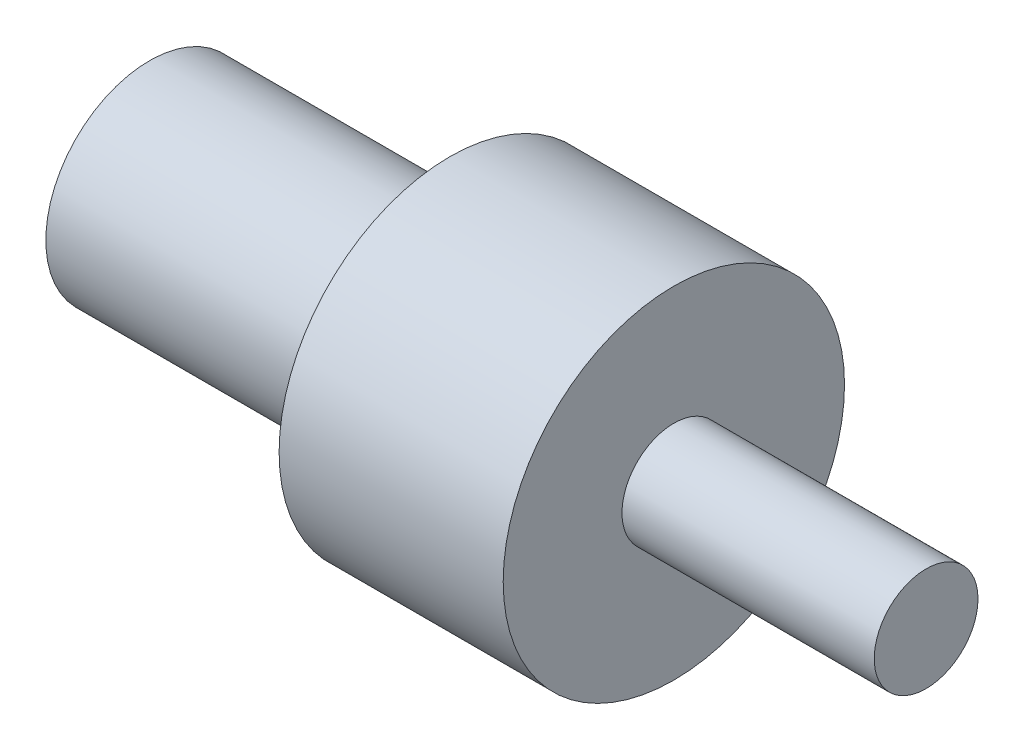
ISO-10303-21;
HEADER;
FILE_DESCRIPTION(('STEP AP214'),'2;1');
FILE_NAME('part.step','',(''),(''),'','','');
FILE_SCHEMA(('AUTOMOTIVE_DESIGN { 1 0 10303 214 1 1 1 1 }'));
ENDSEC;
DATA;
#1=APPLICATION_CONTEXT('core data for automotive mechanical design processes');
#2=APPLICATION_PROTOCOL_DEFINITION('international standard','automotive_design',2000,#1);
#3=PRODUCT_CONTEXT('',#1,'mechanical');
#4=PRODUCT('Part','Part','',(#3));
#5=PRODUCT_RELATED_PRODUCT_CATEGORY('part','',(#4));
#6=PRODUCT_DEFINITION_FORMATION('','',#4);
#7=PRODUCT_DEFINITION_CONTEXT('part definition',#1,'design');
#8=PRODUCT_DEFINITION('design','',#6,#7);
#9=PRODUCT_DEFINITION_SHAPE('','',#8);
#10=(LENGTH_UNIT() NAMED_UNIT(*) SI_UNIT(.MILLI.,.METRE.));
#11=(NAMED_UNIT(*) PLANE_ANGLE_UNIT() SI_UNIT($,.RADIAN.));
#12=(NAMED_UNIT(*) SI_UNIT($,.STERADIAN.) SOLID_ANGLE_UNIT());
#13=UNCERTAINTY_MEASURE_WITH_UNIT(LENGTH_MEASURE(1.E-05),#10,'distance_accuracy_value','');
#14=(GEOMETRIC_REPRESENTATION_CONTEXT(3) GLOBAL_UNCERTAINTY_ASSIGNED_CONTEXT((#13)) GLOBAL_UNIT_ASSIGNED_CONTEXT((#10,
#11,#12)) REPRESENTATION_CONTEXT('',''));
#15=CARTESIAN_POINT('',(0.,0.,0.));
#16=DIRECTION('',(0.,0.,1.));
#17=DIRECTION('',(1.,0.,0.));
#18=AXIS2_PLACEMENT_3D('',#15,#16,#17);
#19=CARTESIAN_POINT('',(0.,0.,0.));
#20=DIRECTION('',(-1.,0.,0.));
#21=DIRECTION('',(0.,0.,1.));
#22=AXIS2_PLACEMENT_3D('',#19,#20,#21);
#23=PLANE('',#22);
#24=CARTESIAN_POINT('',(0.,0.,0.));
#25=DIRECTION('',(1.,0.,0.));
#26=DIRECTION('',(0.,0.,-1.));
#27=AXIS2_PLACEMENT_3D('',#24,#25,#26);
#28=CIRCLE('',#27,17.5457356189353);
#29=CARTESIAN_POINT('',(0.,0.,-17.5457356189353));
#30=VERTEX_POINT('',#29);
#31=EDGE_CURVE('E10',#30,#30,#28,.T.);
#32=ORIENTED_EDGE('',*,*,#31,.F.);
#33=EDGE_LOOP('',(#32));
#34=FACE_BOUND('',#33,.T.);
#35=ADVANCED_FACE('F33',(#34),#23,.T.);
#36=CARTESIAN_POINT('',(131.285594605184,0.,0.));
#37=DIRECTION('',(1.,0.,0.));
#38=DIRECTION('',(0.,0.,-1.));
#39=AXIS2_PLACEMENT_3D('',#36,#37,#38);
#40=CYLINDRICAL_SURFACE('',#39,17.5457356189353);
#41=ORIENTED_EDGE('',*,*,#31,.T.);
#42=EDGE_LOOP('',(#41));
#43=FACE_BOUND('',#42,.T.);
#44=CARTESIAN_POINT('',(50.7491670867616,0.,0.));
#45=DIRECTION('',(1.,0.,0.));
#46=DIRECTION('',(0.,0.,-1.));
#47=AXIS2_PLACEMENT_3D('',#44,#45,#46);
#48=CIRCLE('',#47,17.5457356189353);
#49=CARTESIAN_POINT('',(50.7491670867616,0.,-17.5457356189353));
#50=VERTEX_POINT('',#49);
#51=EDGE_CURVE('E39',#50,#50,#48,.T.);
#52=ORIENTED_EDGE('',*,*,#51,.F.);
#53=EDGE_LOOP('',(#52));
#54=FACE_BOUND('',#53,.T.);
#55=ADVANCED_FACE('F75',(#43,#54),#40,.T.);
#56=CARTESIAN_POINT('',(50.7491670867616,17.5457356189353,0.));
#57=DIRECTION('',(-1.,0.,0.));
#58=DIRECTION('',(0.,0.,1.));
#59=AXIS2_PLACEMENT_3D('',#56,#57,#58);
#60=PLANE('',#59);
#61=ORIENTED_EDGE('',*,*,#51,.T.);
#62=EDGE_LOOP('',(#61));
#63=FACE_BOUND('',#62,.T.);
#64=CARTESIAN_POINT('',(50.7491670867616,0.,0.));
#65=DIRECTION('',(1.,0.,0.));
#66=DIRECTION('',(0.,0.,-1.));
#67=AXIS2_PLACEMENT_3D('',#64,#65,#66);
#68=CIRCLE('',#67,28.8525739651177);
#69=CARTESIAN_POINT('',(50.7491670867616,0.,-28.8525739651177));
#70=VERTEX_POINT('',#69);
#71=EDGE_CURVE('E43',#70,#70,#68,.T.);
#72=ORIENTED_EDGE('',*,*,#71,.F.);
#73=EDGE_LOOP('',(#72));
#74=FACE_BOUND('',#73,.T.);
#75=ADVANCED_FACE('F80',(#63,#74),#60,.T.);
#76=CARTESIAN_POINT('',(131.285594605184,0.,0.));
#77=DIRECTION('',(1.,0.,0.));
#78=DIRECTION('',(0.,0.,-1.));
#79=AXIS2_PLACEMENT_3D('',#76,#77,#78);
#80=CYLINDRICAL_SURFACE('',#79,28.8525739651177);
#81=ORIENTED_EDGE('',*,*,#71,.T.);
#82=EDGE_LOOP('',(#81));
#83=FACE_BOUND('',#82,.T.);
#84=CARTESIAN_POINT('',(88.6369938257239,0.,0.));
#85=DIRECTION('',(1.,0.,0.));
#86=DIRECTION('',(0.,0.,-1.));
#87=AXIS2_PLACEMENT_3D('',#84,#85,#86);
#88=CIRCLE('',#87,28.8525739651177);
#89=CARTESIAN_POINT('',(88.6369938257239,0.,-28.8525739651177));
#90=VERTEX_POINT('',#89);
#91=EDGE_CURVE('E47',#90,#90,#88,.T.);
#92=ORIENTED_EDGE('',*,*,#91,.F.);
#93=EDGE_LOOP('',(#92));
#94=FACE_BOUND('',#93,.T.);
#95=ADVANCED_FACE('F71',(#83,#94),#80,.T.);
#96=CARTESIAN_POINT('',(88.6369938257239,28.8525739651177,0.));
#97=DIRECTION('',(1.,0.,0.));
#98=DIRECTION('',(0.,0.,-1.));
#99=AXIS2_PLACEMENT_3D('',#96,#97,#98);
#100=PLANE('',#99);
#101=ORIENTED_EDGE('',*,*,#91,.T.);
#102=EDGE_LOOP('',(#101));
#103=FACE_BOUND('',#102,.T.);
#104=CARTESIAN_POINT('',(88.6369938257239,0.,0.));
#105=DIRECTION('',(1.,0.,0.));
#106=DIRECTION('',(0.,0.,-1.));
#107=AXIS2_PLACEMENT_3D('',#104,#105,#106);
#108=CIRCLE('',#107,8.77286780946764);
#109=CARTESIAN_POINT('',(88.6369938257239,0.,-8.77286780946764));
#110=VERTEX_POINT('',#109);
#111=EDGE_CURVE('E52',#110,#110,#108,.T.);
#112=ORIENTED_EDGE('',*,*,#111,.F.);
#113=EDGE_LOOP('',(#112));
#114=FACE_BOUND('',#113,.T.);
#115=ADVANCED_FACE('F63',(#103,#114),#100,.T.);
#116=CARTESIAN_POINT('',(131.285594605184,0.,0.));
#117=DIRECTION('',(1.,0.,0.));
#118=DIRECTION('',(0.,0.,-1.));
#119=AXIS2_PLACEMENT_3D('',#116,#117,#118);
#120=CYLINDRICAL_SURFACE('',#119,8.77286780946764);
#121=ORIENTED_EDGE('',*,*,#111,.T.);
#122=EDGE_LOOP('',(#121));
#123=FACE_BOUND('',#122,.T.);
#124=CARTESIAN_POINT('',(131.285594605184,0.,0.));
#125=DIRECTION('',(1.,0.,0.));
#126=DIRECTION('',(0.,0.,-1.));
#127=AXIS2_PLACEMENT_3D('',#124,#125,#126);
#128=CIRCLE('',#127,8.77286780946764);
#129=CARTESIAN_POINT('',(131.285594605184,0.,-8.77286780946764));
#130=VERTEX_POINT('',#129);
#131=EDGE_CURVE('E55',#130,#130,#128,.T.);
#132=ORIENTED_EDGE('',*,*,#131,.F.);
#133=EDGE_LOOP('',(#132));
#134=FACE_BOUND('',#133,.T.);
#135=ADVANCED_FACE('F61',(#123,#134),#120,.T.);
#136=CARTESIAN_POINT('',(131.285594605184,8.77286780946764,0.));
#137=DIRECTION('',(1.,0.,0.));
#138=DIRECTION('',(0.,0.,-1.));
#139=AXIS2_PLACEMENT_3D('',#136,#137,#138);
#140=PLANE('',#139);
#141=ORIENTED_EDGE('',*,*,#131,.T.);
#142=EDGE_LOOP('',(#141));
#143=FACE_BOUND('',#142,.T.);
#144=ADVANCED_FACE('F59',(#143),#140,.T.);
#145=CLOSED_SHELL('',(#35,#55,#75,#95,#115,#135,#144));
#146=MANIFOLD_SOLID_BREP('B2',#145);
#147=ADVANCED_BREP_SHAPE_REPRESENTATION('',(#18,#146),#14);
#148=SHAPE_DEFINITION_REPRESENTATION(#9,#147);
ENDSEC;
END-ISO-10303-21;
